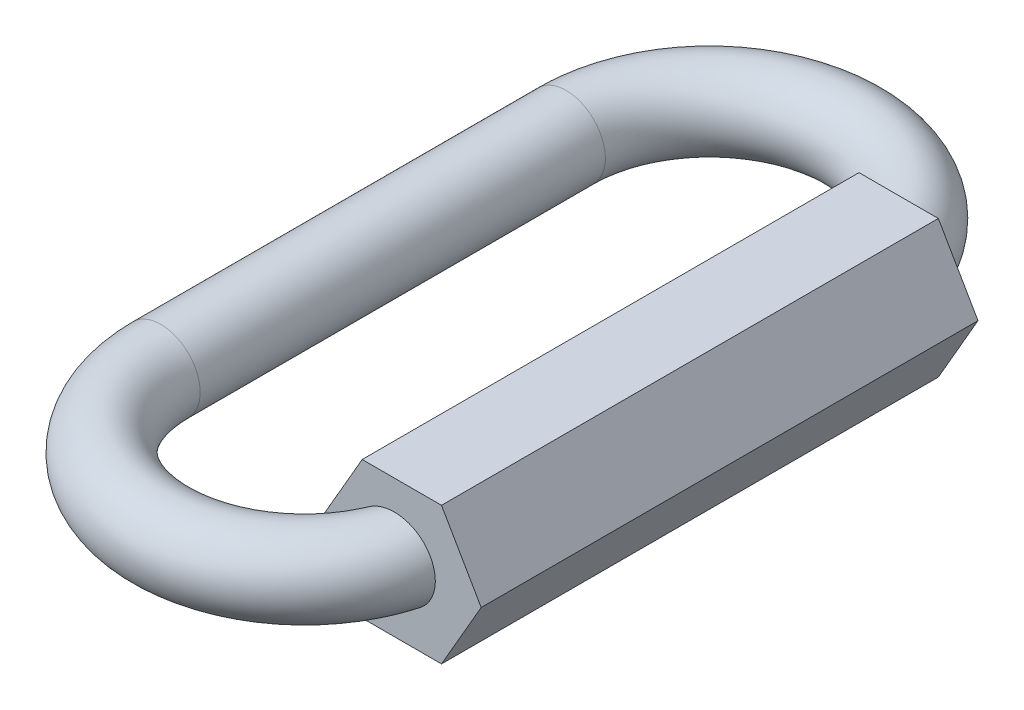
ISO-10303-21;
HEADER;
FILE_DESCRIPTION(('STEP AP214'),'2;1');
FILE_NAME('part.step','',(''),(''),'','','');
FILE_SCHEMA(('AUTOMOTIVE_DESIGN { 1 0 10303 214 1 1 1 1 }'));
ENDSEC;
DATA;
#1=APPLICATION_CONTEXT('core data for automotive mechanical design processes');
#2=APPLICATION_PROTOCOL_DEFINITION('international standard','automotive_design',2000,#1);
#3=PRODUCT_CONTEXT('',#1,'mechanical');
#4=PRODUCT('Part','Part','',(#3));
#5=PRODUCT_RELATED_PRODUCT_CATEGORY('part','',(#4));
#6=PRODUCT_DEFINITION_FORMATION('','',#4);
#7=PRODUCT_DEFINITION_CONTEXT('part definition',#1,'design');
#8=PRODUCT_DEFINITION('design','',#6,#7);
#9=PRODUCT_DEFINITION_SHAPE('','',#8);
#10=(LENGTH_UNIT() NAMED_UNIT(*) SI_UNIT(.MILLI.,.METRE.));
#11=(NAMED_UNIT(*) PLANE_ANGLE_UNIT() SI_UNIT($,.RADIAN.));
#12=(NAMED_UNIT(*) SI_UNIT($,.STERADIAN.) SOLID_ANGLE_UNIT());
#13=UNCERTAINTY_MEASURE_WITH_UNIT(LENGTH_MEASURE(1.E-05),#10,'distance_accuracy_value','');
#14=(GEOMETRIC_REPRESENTATION_CONTEXT(3) GLOBAL_UNCERTAINTY_ASSIGNED_CONTEXT((#13)) GLOBAL_UNIT_ASSIGNED_CONTEXT((#10,
#11,#12)) REPRESENTATION_CONTEXT('',''));
#15=CARTESIAN_POINT('',(0.,0.,0.));
#16=DIRECTION('',(0.,0.,1.));
#17=DIRECTION('',(1.,0.,0.));
#18=AXIS2_PLACEMENT_3D('',#15,#16,#17);
#19=CARTESIAN_POINT('',(0.,0.,-16.));
#20=DIRECTION('',(0.,0.,1.));
#21=DIRECTION('',(1.,0.,0.));
#22=AXIS2_PLACEMENT_3D('',#19,#20,#21);
#23=PLANE('',#22);
#24=DIRECTION('',(-1.,0.,0.));
#25=VECTOR('',#24,1.);
#26=CARTESIAN_POINT('',(2.5547749411641,4.425,-16.));
#27=LINE('',#26,#25);
#28=CARTESIAN_POINT('',(2.5547749411641,4.425,-16.));
#29=VERTEX_POINT('',#28);
#30=CARTESIAN_POINT('',(-2.55477494116409,4.425,-16.));
#31=VERTEX_POINT('',#30);
#32=EDGE_CURVE('E104',#29,#31,#27,.T.);
#33=ORIENTED_EDGE('',*,*,#32,.F.);
#34=DIRECTION('',(-0.5,0.866025403784439,0.));
#35=VECTOR('',#34,1.);
#36=CARTESIAN_POINT('',(5.10954988232819,0.,-16.));
#37=LINE('',#36,#35);
#38=CARTESIAN_POINT('',(5.10954988232819,0.,-16.));
#39=VERTEX_POINT('',#38);
#40=EDGE_CURVE('E109',#39,#29,#37,.T.);
#41=ORIENTED_EDGE('',*,*,#40,.F.);
#42=DIRECTION('',(0.5,0.866025403784439,0.));
#43=VECTOR('',#42,1.);
#44=CARTESIAN_POINT('',(2.55477494116409,-4.425,-16.));
#45=LINE('',#44,#43);
#46=CARTESIAN_POINT('',(2.55477494116409,-4.425,-16.));
#47=VERTEX_POINT('',#46);
#48=EDGE_CURVE('E142',#47,#39,#45,.T.);
#49=ORIENTED_EDGE('',*,*,#48,.F.);
#50=DIRECTION('',(1.,0.,0.));
#51=VECTOR('',#50,1.);
#52=CARTESIAN_POINT('',(-2.5547749411641,-4.425,-16.));
#53=LINE('',#52,#51);
#54=CARTESIAN_POINT('',(-2.5547749411641,-4.425,-16.));
#55=VERTEX_POINT('',#54);
#56=EDGE_CURVE('E139',#55,#47,#53,.T.);
#57=ORIENTED_EDGE('',*,*,#56,.F.);
#58=DIRECTION('',(0.5,-0.866025403784439,0.));
#59=VECTOR('',#58,1.);
#60=CARTESIAN_POINT('',(-5.10954988232819,0.,-16.));
#61=LINE('',#60,#59);
#62=CARTESIAN_POINT('',(-5.10954988232819,0.,-16.));
#63=VERTEX_POINT('',#62);
#64=EDGE_CURVE('E136',#63,#55,#61,.T.);
#65=ORIENTED_EDGE('',*,*,#64,.F.);
#66=DIRECTION('',(-0.5,-0.866025403784439,0.));
#67=VECTOR('',#66,1.);
#68=CARTESIAN_POINT('',(-2.55477494116409,4.425,-16.));
#69=LINE('',#68,#67);
#70=EDGE_CURVE('E134',#31,#63,#69,.T.);
#71=ORIENTED_EDGE('',*,*,#70,.F.);
#72=EDGE_LOOP('',(#33,#41,#49,#57,#65,#71));
#73=FACE_BOUND('',#72,.T.);
#74=CARTESIAN_POINT('',(-3.06900413536494,-0.801609790145161,-16.));
#75=CARTESIAN_POINT('',(-3.01909351343685,-0.936363503355609,-16.));
#76=CARTESIAN_POINT('',(-2.95688127019971,-1.06673171723537,-16.));
#77=CARTESIAN_POINT('',(-2.81090149906449,-1.31498422112775,-16.));
#78=CARTESIAN_POINT('',(-2.72708325250222,-1.4328382030191,-16.));
#79=CARTESIAN_POINT('',(-2.54172024753748,-1.65272885793883,-16.));
#80=CARTESIAN_POINT('',(-2.44025489208379,-1.7548326722037,-16.));
#81=CARTESIAN_POINT('',(-2.22267898122295,-1.9418401468518,-16.));
#82=CARTESIAN_POINT('',(-2.10657342130815,-2.0267496486009,-16.));
#83=CARTESIAN_POINT('',(-1.85451503240919,-2.18305460665647,-16.));
#84=CARTESIAN_POINT('',(-1.71774998530612,-2.25314171050424,-16.));
#85=CARTESIAN_POINT('',(-1.43474640324376,-2.37055087342658,-16.));
#86=CARTESIAN_POINT('',(-1.28850452355718,-2.41786484481509,-16.));
#87=CARTESIAN_POINT('',(-0.983433431555195,-2.49014638260548,-16.));
#88=CARTESIAN_POINT('',(-0.824334720861344,-2.51398373731019,-16.));
#89=CARTESIAN_POINT('',(-0.504376810758348,-2.53446285675912,-16.));
#90=CARTESIAN_POINT('',(-0.343517567407138,-2.53110394114424,-16.));
#91=CARTESIAN_POINT('',(-0.0256618986446927,-2.49690259408987,-16.));
#92=CARTESIAN_POINT('',(0.13135151117211,-2.46621956108199,-16.));
#93=CARTESIAN_POINT('',(0.43762553258376,-2.37790755269611,-16.));
#94=CARTESIAN_POINT('',(0.586887619389329,-2.32028372565304,-16.));
#95=CARTESIAN_POINT('',(0.867448038032218,-2.18190150489549,-16.));
#96=CARTESIAN_POINT('',(0.999206264996456,-2.10207630039365,-16.));
#97=CARTESIAN_POINT('',(1.24662791439162,-1.92047933347772,-16.));
#98=CARTESIAN_POINT('',(1.36229542792527,-1.81871316644663,-16.));
#99=CARTESIAN_POINT('',(1.56884744521657,-1.60097771795354,-16.));
#100=CARTESIAN_POINT('',(1.66059811984797,-1.48582983916977,-16.));
#101=CARTESIAN_POINT('',(1.82260751569294,-1.24129153891539,-16.));
#102=CARTESIAN_POINT('',(1.89287102219418,-1.11190429735538,-16.));
#103=CARTESIAN_POINT('',(2.00735863427976,-0.84758468646424,-16.));
#104=CARTESIAN_POINT('',(2.05242497109594,-0.713016712173273,-16.));
#105=CARTESIAN_POINT('',(2.11878380012589,-0.438143557109762,-16.));
#106=CARTESIAN_POINT('',(2.14007963109195,-0.297839184929372,-16.));
#107=CARTESIAN_POINT('',(2.1579874983122,-0.0186200287027689,-16.));
#108=CARTESIAN_POINT('',(2.15510609574921,0.120262516628913,-16.));
#109=CARTESIAN_POINT('',(2.12596290955776,0.39554573220375,-16.));
#110=CARTESIAN_POINT('',(2.09970230566197,0.531946527323558,-16.));
#111=CARTESIAN_POINT('',(2.02480932622923,0.797869644837646,-16.));
#112=CARTESIAN_POINT('',(1.97626538227519,0.927416919914012,-16.));
#113=CARTESIAN_POINT('',(1.85838271452179,1.17666533177516,-16.));
#114=CARTESIAN_POINT('',(1.78904327357627,1.29636612881634,-16.));
#115=CARTESIAN_POINT('',(1.6306991626606,1.52424289065856,-16.));
#116=CARTESIAN_POINT('',(1.54145374926007,1.63225140846116,-16.));
#117=CARTESIAN_POINT('',(1.34654188050046,1.83224756018794,-16.));
#118=CARTESIAN_POINT('',(1.24087364848552,1.92423345846465,-16.));
#119=CARTESIAN_POINT('',(1.01303904293868,2.09238300156938,-16.));
#120=CARTESIAN_POINT('',(0.890495312656878,2.16803496175709,-16.));
#121=CARTESIAN_POINT('',(0.634819636473529,2.29857405412186,-16.));
#122=CARTESIAN_POINT('',(0.501685896736691,2.35345765925634,-16.));
#123=CARTESIAN_POINT('',(0.223088141399425,2.44321661026248,-16.));
#124=CARTESIAN_POINT('',(0.0773456622172722,2.47722716406105,-16.));
#125=CARTESIAN_POINT('',(-0.217704025009056,2.52138476989456,-16.));
#126=CARTESIAN_POINT('',(-0.367011980050677,2.53152677616294,-16.));
#127=CARTESIAN_POINT('',(-0.671692423394591,2.5280294175261,-16.));
#128=CARTESIAN_POINT('',(-0.827053352685859,2.51336246200072,-16.));
#129=CARTESIAN_POINT('',(-1.1333365329374,2.45896976739161,-16.));
#130=CARTESIAN_POINT('',(-1.2842577896496,2.41923845928562,-16.));
#131=CARTESIAN_POINT('',(-1.58214223485238,2.31425364020075,-16.));
#132=CARTESIAN_POINT('',(-1.72884583971759,2.248261354253,-16.));
#133=CARTESIAN_POINT('',(-2.00905174382948,2.09243263323473,-16.));
#134=CARTESIAN_POINT('',(-2.14255195654584,2.00259243772001,-16.));
#135=CARTESIAN_POINT('',(-2.3910919911656,1.80179932011212,-16.));
#136=CARTESIAN_POINT('',(-2.50625662505924,1.69100146668601,-16.));
#137=CARTESIAN_POINT('',(-2.71477547732237,1.450453264465,-16.));
#138=CARTESIAN_POINT('',(-2.80813970933333,1.32071166184475,-16.));
#139=CARTESIAN_POINT('',(-2.96323209320142,1.05491478733935,-16.));
#140=CARTESIAN_POINT('',(-3.02664523929416,0.919845880975425,-16.));
#141=CARTESIAN_POINT('',(-3.12711357895555,0.640201851585324,-16.));
#142=CARTESIAN_POINT('',(-3.16418352473017,0.495632098674113,-16.));
#143=CARTESIAN_POINT('',(-3.20748446000285,0.216187216321993,-16.));
#144=CARTESIAN_POINT('',(-3.21633204571152,0.0817120028597768,-16.));
#145=CARTESIAN_POINT('',(-3.21011255778352,-0.186539961220946,-16.));
#146=CARTESIAN_POINT('',(-3.19508654709235,-0.320317514928167,-16.));
#147=CARTESIAN_POINT('',(-3.15660511449657,-0.51115434698607,-16.));
#148=CARTESIAN_POINT('',(-3.14224477239156,-0.570183887684114,-16.));
#149=CARTESIAN_POINT('',(-3.10898933939413,-0.686939762221844,-16.));
#150=CARTESIAN_POINT('',(-3.09009508175505,-0.744666333393942,-16.));
#151=CARTESIAN_POINT('',(-3.06900413536494,-0.801609790145161,-16.));
#152=B_SPLINE_CURVE_WITH_KNOTS('',3,(#74,#75,#76,#77,#78,#79,#80,#81,#82,#83,#84,#85,#86,#87,
#88,#89,#90,#91,#92,#93,#94,#95,#96,#97,#98,#99,#100,#101,#102,#103,#104,#105,#106,#107,#108,
#109,#110,#111,#112,#113,#114,#115,#116,#117,#118,#119,#120,#121,#122,#123,#124,#125,#126,#127,
#128,#129,#130,#131,#132,#133,#134,#135,#136,#137,#138,#139,#140,#141,#142,#143,#144,#145,#146,
#147,#148,#149,#150,#151),.UNSPECIFIED.,.T.,.F.,(4,2,2,2,2,2,2,2,2,2,2,2,2,2,2,2,2,2,2,2,2,2,2,
2,2,2,2,2,2,2,2,2,2,2,2,2,2,2,4),(0.,0.430853338357914,0.862727435959984,1.292706349955,
1.72253894268935,2.18154483007291,2.64071360947005,3.12104130673059,3.60138102020994,
4.07893683941416,4.55640143588026,5.0162290663698,5.47593957005606,5.91543380313208,
6.35483008749346,6.7784944538797,7.20209930582224,7.61685131297658,8.03158239260845,
8.44468165172102,8.85779515846704,9.27620550320598,9.69466114402392,10.1247645518853,
10.5549409704853,11.0019118366957,11.4489771832317,11.9150167435328,12.3811598891642,
12.8614660820687,13.3418480568216,13.8188056003493,14.2955436287152,14.740725337393,
15.1856575472032,15.5879195289527,15.989490362729,16.1715913542251,16.353658904383),.UNSPECIFIED.);
#153=CARTESIAN_POINT('',(-3.06900413536494,-0.801609790145161,-16.));
#154=VERTEX_POINT('',#153);
#155=EDGE_CURVE('E11',#154,#154,#152,.T.);
#156=ORIENTED_EDGE('',*,*,#155,.T.);
#157=EDGE_LOOP('',(#156));
#158=FACE_BOUND('',#157,.T.);
#159=ADVANCED_FACE('F41',(#73,#158),#23,.F.);
#160=CARTESIAN_POINT('',(0.,0.,16.));
#161=DIRECTION('',(0.,0.,1.));
#162=DIRECTION('',(1.,0.,0.));
#163=AXIS2_PLACEMENT_3D('',#160,#161,#162);
#164=PLANE('',#163);
#165=DIRECTION('',(-1.,0.,0.));
#166=VECTOR('',#165,1.);
#167=CARTESIAN_POINT('',(2.5547749411641,4.425,16.));
#168=LINE('',#167,#166);
#169=CARTESIAN_POINT('',(2.5547749411641,4.425,16.));
#170=VERTEX_POINT('',#169);
#171=CARTESIAN_POINT('',(-2.55477494116409,4.425,16.));
#172=VERTEX_POINT('',#171);
#173=EDGE_CURVE('E103',#170,#172,#168,.T.);
#174=ORIENTED_EDGE('',*,*,#173,.T.);
#175=DIRECTION('',(-0.5,-0.866025403784439,0.));
#176=VECTOR('',#175,1.);
#177=CARTESIAN_POINT('',(-2.55477494116409,4.425,16.));
#178=LINE('',#177,#176);
#179=CARTESIAN_POINT('',(-5.10954988232819,0.,16.));
#180=VERTEX_POINT('',#179);
#181=EDGE_CURVE('E112',#172,#180,#178,.T.);
#182=ORIENTED_EDGE('',*,*,#181,.T.);
#183=DIRECTION('',(0.5,-0.866025403784439,0.));
#184=VECTOR('',#183,1.);
#185=CARTESIAN_POINT('',(-5.10954988232819,0.,16.));
#186=LINE('',#185,#184);
#187=CARTESIAN_POINT('',(-2.5547749411641,-4.425,16.));
#188=VERTEX_POINT('',#187);
#189=EDGE_CURVE('E117',#180,#188,#186,.T.);
#190=ORIENTED_EDGE('',*,*,#189,.T.);
#191=DIRECTION('',(1.,0.,0.));
#192=VECTOR('',#191,1.);
#193=CARTESIAN_POINT('',(-2.5547749411641,-4.425,16.));
#194=LINE('',#193,#192);
#195=CARTESIAN_POINT('',(2.55477494116409,-4.425,16.));
#196=VERTEX_POINT('',#195);
#197=EDGE_CURVE('E127',#188,#196,#194,.T.);
#198=ORIENTED_EDGE('',*,*,#197,.T.);
#199=DIRECTION('',(0.5,0.866025403784439,0.));
#200=VECTOR('',#199,1.);
#201=CARTESIAN_POINT('',(2.55477494116409,-4.425,16.));
#202=LINE('',#201,#200);
#203=CARTESIAN_POINT('',(5.10954988232819,0.,16.));
#204=VERTEX_POINT('',#203);
#205=EDGE_CURVE('E130',#196,#204,#202,.T.);
#206=ORIENTED_EDGE('',*,*,#205,.T.);
#207=DIRECTION('',(-0.5,0.866025403784439,0.));
#208=VECTOR('',#207,1.);
#209=CARTESIAN_POINT('',(5.10954988232819,0.,16.));
#210=LINE('',#209,#208);
#211=EDGE_CURVE('E123',#204,#170,#210,.T.);
#212=ORIENTED_EDGE('',*,*,#211,.T.);
#213=EDGE_LOOP('',(#174,#182,#190,#198,#206,#212));
#214=FACE_BOUND('',#213,.T.);
#215=CARTESIAN_POINT('',(-3.06900413536494,-0.801609790145162,16.));
#216=CARTESIAN_POINT('',(-3.01909351343685,-0.93636350335561,16.));
#217=CARTESIAN_POINT('',(-2.95688127019971,-1.06673171723538,16.));
#218=CARTESIAN_POINT('',(-2.81090149906449,-1.31498422112775,16.));
#219=CARTESIAN_POINT('',(-2.72708325250222,-1.4328382030191,16.));
#220=CARTESIAN_POINT('',(-2.54172024753748,-1.65272885793883,16.));
#221=CARTESIAN_POINT('',(-2.44025489208379,-1.7548326722037,16.));
#222=CARTESIAN_POINT('',(-2.22267898122295,-1.9418401468518,16.));
#223=CARTESIAN_POINT('',(-2.10657342130815,-2.0267496486009,16.));
#224=CARTESIAN_POINT('',(-1.85451503240918,-2.18305460665647,16.));
#225=CARTESIAN_POINT('',(-1.71774998530612,-2.25314171050424,16.));
#226=CARTESIAN_POINT('',(-1.43474640324376,-2.37055087342658,16.));
#227=CARTESIAN_POINT('',(-1.28850452355717,-2.41786484481509,16.));
#228=CARTESIAN_POINT('',(-0.983433431555192,-2.49014638260548,16.));
#229=CARTESIAN_POINT('',(-0.824334720861341,-2.51398373731019,16.));
#230=CARTESIAN_POINT('',(-0.504376810758345,-2.53446285675912,16.));
#231=CARTESIAN_POINT('',(-0.343517567407135,-2.53110394114424,16.));
#232=CARTESIAN_POINT('',(-0.025661898644689,-2.49690259408987,16.));
#233=CARTESIAN_POINT('',(0.131351511172114,-2.46621956108199,16.));
#234=CARTESIAN_POINT('',(0.437625532583765,-2.37790755269611,16.));
#235=CARTESIAN_POINT('',(0.586887619389335,-2.32028372565303,16.));
#236=CARTESIAN_POINT('',(0.867448038032224,-2.18190150489549,16.));
#237=CARTESIAN_POINT('',(0.999206264996461,-2.10207630039365,16.));
#238=CARTESIAN_POINT('',(1.24662791439162,-1.92047933347772,16.));
#239=CARTESIAN_POINT('',(1.36229542792528,-1.81871316644663,16.));
#240=CARTESIAN_POINT('',(1.56884744521657,-1.60097771795354,16.));
#241=CARTESIAN_POINT('',(1.66059811984797,-1.48582983916978,16.));
#242=CARTESIAN_POINT('',(1.82260751569294,-1.24129153891539,16.));
#243=CARTESIAN_POINT('',(1.89287102219419,-1.11190429735538,16.));
#244=CARTESIAN_POINT('',(2.00735863427976,-0.847584686464245,16.));
#245=CARTESIAN_POINT('',(2.05242497109594,-0.713016712173278,16.));
#246=CARTESIAN_POINT('',(2.1187838001259,-0.438143557109765,16.));
#247=CARTESIAN_POINT('',(2.14007963109196,-0.297839184929375,16.));
#248=CARTESIAN_POINT('',(2.1579874983122,-0.0186200287027712,16.));
#249=CARTESIAN_POINT('',(2.15510609574921,0.120262516628911,16.));
#250=CARTESIAN_POINT('',(2.12596290955776,0.395545732203749,16.));
#251=CARTESIAN_POINT('',(2.09970230566197,0.531946527323557,16.));
#252=CARTESIAN_POINT('',(2.02480932622923,0.797869644837645,16.));
#253=CARTESIAN_POINT('',(1.97626538227519,0.927416919914011,16.));
#254=CARTESIAN_POINT('',(1.85838271452179,1.17666533177516,16.));
#255=CARTESIAN_POINT('',(1.78904327357627,1.29636612881634,16.));
#256=CARTESIAN_POINT('',(1.6306991626606,1.52424289065856,16.));
#257=CARTESIAN_POINT('',(1.54145374926008,1.63225140846116,16.));
#258=CARTESIAN_POINT('',(1.34654188050046,1.83224756018794,16.));
#259=CARTESIAN_POINT('',(1.24087364848552,1.92423345846465,16.));
#260=CARTESIAN_POINT('',(1.01303904293869,2.09238300156938,16.));
#261=CARTESIAN_POINT('',(0.890495312656881,2.16803496175709,16.));
#262=CARTESIAN_POINT('',(0.634819636473531,2.29857405412186,16.));
#263=CARTESIAN_POINT('',(0.501685896736693,2.35345765925634,16.));
#264=CARTESIAN_POINT('',(0.223088141399426,2.44321661026248,16.));
#265=CARTESIAN_POINT('',(0.0773456622172735,2.47722716406105,16.));
#266=CARTESIAN_POINT('',(-0.217704025009054,2.52138476989456,16.));
#267=CARTESIAN_POINT('',(-0.367011980050675,2.53152677616294,16.));
#268=CARTESIAN_POINT('',(-0.671692423394588,2.5280294175261,16.));
#269=CARTESIAN_POINT('',(-0.827053352685857,2.51336246200072,16.));
#270=CARTESIAN_POINT('',(-1.13333653293739,2.45896976739161,16.));
#271=CARTESIAN_POINT('',(-1.28425778964959,2.41923845928562,16.));
#272=CARTESIAN_POINT('',(-1.58214223485237,2.31425364020075,16.));
#273=CARTESIAN_POINT('',(-1.72884583971758,2.248261354253,16.));
#274=CARTESIAN_POINT('',(-2.00905174382948,2.09243263323473,16.));
#275=CARTESIAN_POINT('',(-2.14255195654584,2.00259243772001,16.));
#276=CARTESIAN_POINT('',(-2.3910919911656,1.80179932011212,16.));
#277=CARTESIAN_POINT('',(-2.50625662505924,1.691001466686,16.));
#278=CARTESIAN_POINT('',(-2.71477547732237,1.450453264465,16.));
#279=CARTESIAN_POINT('',(-2.80813970933332,1.32071166184475,16.));
#280=CARTESIAN_POINT('',(-2.96323209320142,1.05491478733935,16.));
#281=CARTESIAN_POINT('',(-3.02664523929415,0.919845880975426,16.));
#282=CARTESIAN_POINT('',(-3.12711357895555,0.640201851585324,16.));
#283=CARTESIAN_POINT('',(-3.16418352473017,0.495632098674114,16.));
#284=CARTESIAN_POINT('',(-3.20748446000284,0.216187216321994,16.));
#285=CARTESIAN_POINT('',(-3.21633204571152,0.0817120028597781,16.));
#286=CARTESIAN_POINT('',(-3.21011255778351,-0.186539961220945,16.));
#287=CARTESIAN_POINT('',(-3.19508654709235,-0.320317514928166,16.));
#288=CARTESIAN_POINT('',(-3.15660511449656,-0.51115434698607,16.));
#289=CARTESIAN_POINT('',(-3.14224477239155,-0.570183887684114,16.));
#290=CARTESIAN_POINT('',(-3.10898933939413,-0.686939762221844,16.));
#291=CARTESIAN_POINT('',(-3.09009508175504,-0.744666333393942,16.));
#292=CARTESIAN_POINT('',(-3.06900413536494,-0.801609790145162,16.));
#293=B_SPLINE_CURVE_WITH_KNOTS('',3,(#215,#216,#217,#218,#219,#220,#221,#222,#223,#224,#225,
#226,#227,#228,#229,#230,#231,#232,#233,#234,#235,#236,#237,#238,#239,#240,#241,#242,#243,#244,
#245,#246,#247,#248,#249,#250,#251,#252,#253,#254,#255,#256,#257,#258,#259,#260,#261,#262,#263,
#264,#265,#266,#267,#268,#269,#270,#271,#272,#273,#274,#275,#276,#277,#278,#279,#280,#281,#282,
#283,#284,#285,#286,#287,#288,#289,#290,#291,#292),.UNSPECIFIED.,.T.,.F.,(4,2,2,2,2,2,2,2,2,2,2,
2,2,2,2,2,2,2,2,2,2,2,2,2,2,2,2,2,2,2,2,2,2,2,2,2,2,2,4),(0.,0.430853338357914,
0.862727435959985,1.29270634995501,1.72253894268935,2.18154483007291,2.64071360947005,
3.12104130673059,3.60138102020994,4.07893683941416,4.55640143588027,5.01622906636981,
5.47593957005606,5.91543380313208,6.35483008749346,6.7784944538797,7.20209930582224,
7.61685131297658,8.03158239260845,8.44468165172103,8.85779515846704,9.27620550320598,
9.69466114402392,10.1247645518853,10.5549409704853,11.0019118366957,11.4489771832317,
11.9150167435328,12.3811598891642,12.8614660820687,13.3418480568216,13.8188056003493,
14.2955436287152,14.740725337393,15.1856575472032,15.5879195289527,15.989490362729,
16.1715913542251,16.353658904383),.UNSPECIFIED.);
#294=CARTESIAN_POINT('',(-3.06900413536494,-0.801609790145162,16.));
#295=VERTEX_POINT('',#294);
#296=EDGE_CURVE('E146',#295,#295,#293,.T.);
#297=ORIENTED_EDGE('',*,*,#296,.F.);
#298=EDGE_LOOP('',(#297));
#299=FACE_BOUND('',#298,.T.);
#300=ADVANCED_FACE('F120',(#214,#299),#164,.T.);
#301=CARTESIAN_POINT('',(2.5547749411641,4.425,-16.));
#302=DIRECTION('',(0.,1.,0.));
#303=DIRECTION('',(0.,0.,1.));
#304=AXIS2_PLACEMENT_3D('',#301,#302,#303);
#305=PLANE('',#304);
#306=DIRECTION('',(0.,0.,1.));
#307=VECTOR('',#306,1.);
#308=CARTESIAN_POINT('',(-2.55477494116409,4.425,-16.));
#309=LINE('',#308,#307);
#310=EDGE_CURVE('E99',#31,#172,#309,.T.);
#311=ORIENTED_EDGE('',*,*,#310,.T.);
#312=ORIENTED_EDGE('',*,*,#173,.F.);
#313=DIRECTION('',(0.,0.,1.));
#314=VECTOR('',#313,1.);
#315=CARTESIAN_POINT('',(2.5547749411641,4.425,-16.));
#316=LINE('',#315,#314);
#317=EDGE_CURVE('E62',#29,#170,#316,.T.);
#318=ORIENTED_EDGE('',*,*,#317,.F.);
#319=ORIENTED_EDGE('',*,*,#32,.T.);
#320=EDGE_LOOP('',(#311,#312,#318,#319));
#321=FACE_BOUND('',#320,.T.);
#322=ADVANCED_FACE('F101',(#321),#305,.T.);
#323=CARTESIAN_POINT('',(5.10954988232819,0.,-16.));
#324=DIRECTION('',(0.866025403784439,0.5,0.));
#325=DIRECTION('',(-0.5,0.866025403784439,0.));
#326=AXIS2_PLACEMENT_3D('',#323,#324,#325);
#327=PLANE('',#326);
#328=ORIENTED_EDGE('',*,*,#317,.T.);
#329=ORIENTED_EDGE('',*,*,#211,.F.);
#330=DIRECTION('',(0.,0.,1.));
#331=VECTOR('',#330,1.);
#332=CARTESIAN_POINT('',(5.10954988232819,0.,-16.));
#333=LINE('',#332,#331);
#334=EDGE_CURVE('E70',#39,#204,#333,.T.);
#335=ORIENTED_EDGE('',*,*,#334,.F.);
#336=ORIENTED_EDGE('',*,*,#40,.T.);
#337=EDGE_LOOP('',(#328,#329,#335,#336));
#338=FACE_BOUND('',#337,.T.);
#339=ADVANCED_FACE('F168',(#338),#327,.T.);
#340=CARTESIAN_POINT('',(2.55477494116409,-4.425,-16.));
#341=DIRECTION('',(0.866025403784439,-0.5,0.));
#342=DIRECTION('',(0.5,0.866025403784439,0.));
#343=AXIS2_PLACEMENT_3D('',#340,#341,#342);
#344=PLANE('',#343);
#345=ORIENTED_EDGE('',*,*,#334,.T.);
#346=ORIENTED_EDGE('',*,*,#205,.F.);
#347=DIRECTION('',(0.,0.,1.));
#348=VECTOR('',#347,1.);
#349=CARTESIAN_POINT('',(2.55477494116409,-4.425,-16.));
#350=LINE('',#349,#348);
#351=EDGE_CURVE('E148',#47,#196,#350,.T.);
#352=ORIENTED_EDGE('',*,*,#351,.F.);
#353=ORIENTED_EDGE('',*,*,#48,.T.);
#354=EDGE_LOOP('',(#345,#346,#352,#353));
#355=FACE_BOUND('',#354,.T.);
#356=ADVANCED_FACE('F171',(#355),#344,.T.);
#357=CARTESIAN_POINT('',(-2.5547749411641,-4.425,-16.));
#358=DIRECTION('',(0.,-1.,0.));
#359=DIRECTION('',(0.,0.,-1.));
#360=AXIS2_PLACEMENT_3D('',#357,#358,#359);
#361=PLANE('',#360);
#362=ORIENTED_EDGE('',*,*,#351,.T.);
#363=ORIENTED_EDGE('',*,*,#197,.F.);
#364=DIRECTION('',(0.,0.,1.));
#365=VECTOR('',#364,1.);
#366=CARTESIAN_POINT('',(-2.5547749411641,-4.425,-16.));
#367=LINE('',#366,#365);
#368=EDGE_CURVE('E150',#55,#188,#367,.T.);
#369=ORIENTED_EDGE('',*,*,#368,.F.);
#370=ORIENTED_EDGE('',*,*,#56,.T.);
#371=EDGE_LOOP('',(#362,#363,#369,#370));
#372=FACE_BOUND('',#371,.T.);
#373=ADVANCED_FACE('F174',(#372),#361,.T.);
#374=CARTESIAN_POINT('',(-5.10954988232819,0.,-16.));
#375=DIRECTION('',(-0.866025403784439,-0.5,0.));
#376=DIRECTION('',(0.5,-0.866025403784439,0.));
#377=AXIS2_PLACEMENT_3D('',#374,#375,#376);
#378=PLANE('',#377);
#379=ORIENTED_EDGE('',*,*,#368,.T.);
#380=ORIENTED_EDGE('',*,*,#189,.F.);
#381=DIRECTION('',(0.,0.,1.));
#382=VECTOR('',#381,1.);
#383=CARTESIAN_POINT('',(-5.10954988232819,0.,-16.));
#384=LINE('',#383,#382);
#385=EDGE_CURVE('E108',#63,#180,#384,.T.);
#386=ORIENTED_EDGE('',*,*,#385,.F.);
#387=ORIENTED_EDGE('',*,*,#64,.T.);
#388=EDGE_LOOP('',(#379,#380,#386,#387));
#389=FACE_BOUND('',#388,.T.);
#390=ADVANCED_FACE('F178',(#389),#378,.T.);
#391=CARTESIAN_POINT('',(-2.55477494116409,4.425,-16.));
#392=DIRECTION('',(-0.866025403784439,0.5,0.));
#393=DIRECTION('',(-0.5,-0.866025403784439,0.));
#394=AXIS2_PLACEMENT_3D('',#391,#392,#393);
#395=PLANE('',#394);
#396=ORIENTED_EDGE('',*,*,#385,.T.);
#397=ORIENTED_EDGE('',*,*,#181,.F.);
#398=ORIENTED_EDGE('',*,*,#310,.F.);
#399=ORIENTED_EDGE('',*,*,#70,.T.);
#400=EDGE_LOOP('',(#396,#397,#398,#399));
#401=FACE_BOUND('',#400,.T.);
#402=ADVANCED_FACE('F113',(#401),#395,.T.);
#403=CARTESIAN_POINT('',(-9.235,0.,-13.05));
#404=DIRECTION('',(0.,1.,0.));
#405=DIRECTION('',(0.,0.,1.));
#406=AXIS2_PLACEMENT_3D('',#403,#404,#405);
#407=TOROIDAL_SURFACE('',#406,9.235,2.53);
#408=CARTESIAN_POINT('',(-18.47,0.,-13.05));
#409=DIRECTION('',(0.,0.,-1.));
#410=DIRECTION('',(-1.,0.,0.));
#411=AXIS2_PLACEMENT_3D('',#408,#409,#410);
#412=CIRCLE('',#411,2.53);
#413=CARTESIAN_POINT('',(-21.,0.,-13.05));
#414=VERTEX_POINT('',#413);
#415=EDGE_CURVE('E153',#414,#414,#412,.T.);
#416=ORIENTED_EDGE('',*,*,#415,.T.);
#417=EDGE_LOOP('',(#416));
#418=FACE_BOUND('',#417,.T.);
#419=ORIENTED_EDGE('',*,*,#155,.F.);
#420=EDGE_LOOP('',(#419));
#421=FACE_BOUND('',#420,.T.);
#422=ADVANCED_FACE('F185',(#418,#421),#407,.T.);
#423=CARTESIAN_POINT('',(-18.47,0.,-13.05));
#424=DIRECTION('',(0.,0.,1.));
#425=DIRECTION('',(1.,0.,0.));
#426=AXIS2_PLACEMENT_3D('',#423,#424,#425);
#427=CYLINDRICAL_SURFACE('',#426,2.53);
#428=CARTESIAN_POINT('',(-18.47,0.,13.05));
#429=DIRECTION('',(0.,0.,-1.));
#430=DIRECTION('',(-1.,0.,0.));
#431=AXIS2_PLACEMENT_3D('',#428,#429,#430);
#432=CIRCLE('',#431,2.53);
#433=CARTESIAN_POINT('',(-21.,0.,13.05));
#434=VERTEX_POINT('',#433);
#435=EDGE_CURVE('E55',#434,#434,#432,.T.);
#436=ORIENTED_EDGE('',*,*,#435,.T.);
#437=EDGE_LOOP('',(#436));
#438=FACE_BOUND('',#437,.T.);
#439=ORIENTED_EDGE('',*,*,#415,.F.);
#440=EDGE_LOOP('',(#439));
#441=FACE_BOUND('',#440,.T.);
#442=ADVANCED_FACE('F189',(#438,#441),#427,.T.);
#443=CARTESIAN_POINT('',(-9.235,0.,13.05));
#444=DIRECTION('',(0.,1.,0.));
#445=DIRECTION('',(0.,0.,1.));
#446=AXIS2_PLACEMENT_3D('',#443,#444,#445);
#447=TOROIDAL_SURFACE('',#446,9.235,2.53);
#448=ORIENTED_EDGE('',*,*,#296,.T.);
#449=EDGE_LOOP('',(#448));
#450=FACE_BOUND('',#449,.T.);
#451=ORIENTED_EDGE('',*,*,#435,.F.);
#452=EDGE_LOOP('',(#451));
#453=FACE_BOUND('',#452,.T.);
#454=ADVANCED_FACE('F43',(#450,#453),#447,.T.);
#455=CLOSED_SHELL('',(#159,#300,#322,#339,#356,#373,#390,#402,#422,#442,#454));
#456=MANIFOLD_SOLID_BREP('B2',#455);
#457=ADVANCED_BREP_SHAPE_REPRESENTATION('',(#18,#456),#14);
#458=SHAPE_DEFINITION_REPRESENTATION(#9,#457);
ENDSEC;
END-ISO-10303-21;
